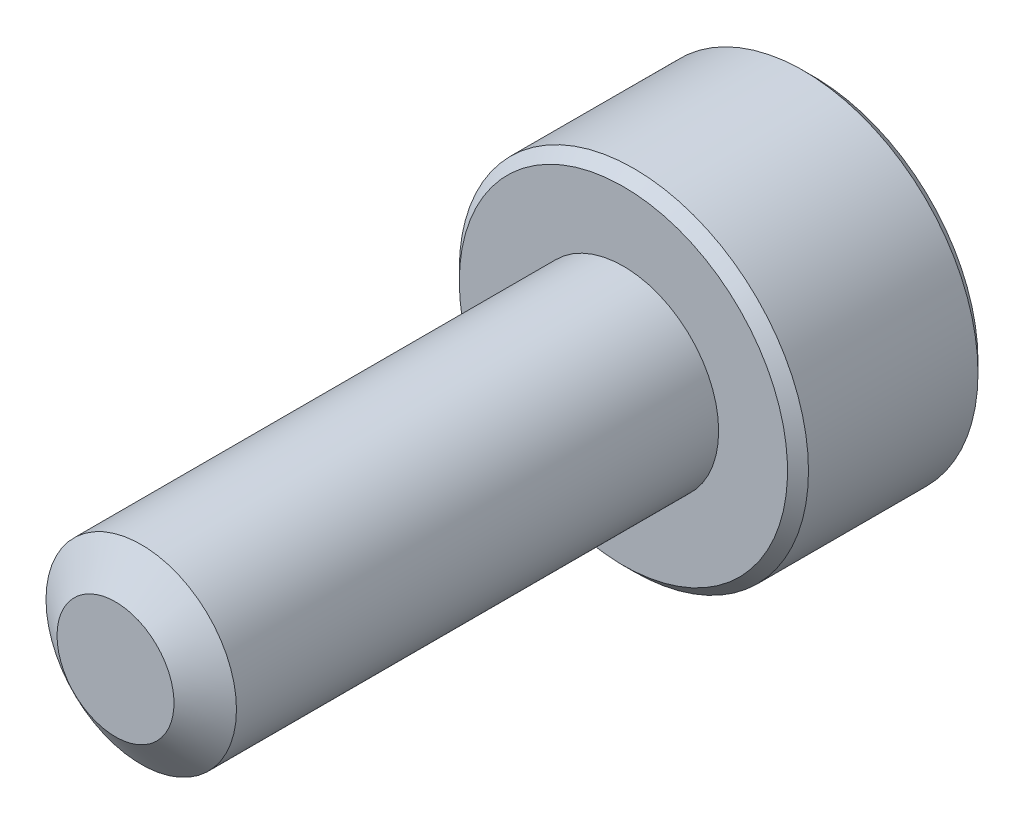
ISO-10303-21;
HEADER;
FILE_DESCRIPTION(('STEP AP214'),'2;1');
FILE_NAME('part.step','',(''),(''),'','','');
FILE_SCHEMA(('AUTOMOTIVE_DESIGN { 1 0 10303 214 1 1 1 1 }'));
ENDSEC;
DATA;
#1=APPLICATION_CONTEXT('core data for automotive mechanical design processes');
#2=APPLICATION_PROTOCOL_DEFINITION('international standard','automotive_design',2000,#1);
#3=PRODUCT_CONTEXT('',#1,'mechanical');
#4=PRODUCT('Part','Part','',(#3));
#5=PRODUCT_RELATED_PRODUCT_CATEGORY('part','',(#4));
#6=PRODUCT_DEFINITION_FORMATION('','',#4);
#7=PRODUCT_DEFINITION_CONTEXT('part definition',#1,'design');
#8=PRODUCT_DEFINITION('design','',#6,#7);
#9=PRODUCT_DEFINITION_SHAPE('','',#8);
#10=(LENGTH_UNIT() NAMED_UNIT(*) SI_UNIT(.MILLI.,.METRE.));
#11=(NAMED_UNIT(*) PLANE_ANGLE_UNIT() SI_UNIT($,.RADIAN.));
#12=(NAMED_UNIT(*) SI_UNIT($,.STERADIAN.) SOLID_ANGLE_UNIT());
#13=UNCERTAINTY_MEASURE_WITH_UNIT(LENGTH_MEASURE(1.E-05),#10,'distance_accuracy_value','');
#14=(GEOMETRIC_REPRESENTATION_CONTEXT(3) GLOBAL_UNCERTAINTY_ASSIGNED_CONTEXT((#13)) GLOBAL_UNIT_ASSIGNED_CONTEXT((#10,
#11,#12)) REPRESENTATION_CONTEXT('',''));
#15=CARTESIAN_POINT('',(0.,0.,0.));
#16=DIRECTION('',(0.,0.,1.));
#17=DIRECTION('',(1.,0.,0.));
#18=AXIS2_PLACEMENT_3D('',#15,#16,#17);
#19=CARTESIAN_POINT('',(0.,-1.44337567297406,-9.125));
#20=DIRECTION('',(-0.5,-0.866025403784439,0.));
#21=DIRECTION('',(0.866025403784439,-0.5,0.));
#22=AXIS2_PLACEMENT_3D('',#19,#20,#21);
#23=PLANE('',#22);
#24=CARTESIAN_POINT('',(-1.24999999999923,-0.721687836487472,-11.0000000000205));
#25=CARTESIAN_POINT('',(-1.20703689149526,-0.746492598747462,-10.9752190397385));
#26=CARTESIAN_POINT('',(-1.16335543595367,-0.771712098862997,-10.9518937494833));
#27=CARTESIAN_POINT('',(-1.07428446543606,-0.823137247668316,-10.9091861389306));
#28=CARTESIAN_POINT('',(-1.02888648443478,-0.849347784220073,-10.8898275733697));
#29=CARTESIAN_POINT('',(-0.937343688522001,-0.902200042082686,-10.8566662159237));
#30=CARTESIAN_POINT('',(-0.891222174141652,-0.928828310825614,-10.8427800967941));
#31=CARTESIAN_POINT('',(-0.797964038891582,-0.982670920316364,-10.8213859018106));
#32=CARTESIAN_POINT('',(-0.750830264933908,-1.00988361739875,-10.8138618619324));
#33=CARTESIAN_POINT('',(-0.669590913522095,-1.05678717880515,-10.807072827807));
#34=CARTESIAN_POINT('',(-0.635590177984652,-1.07641751262034,-10.8060681886655));
#35=CARTESIAN_POINT('',(-0.567648554675665,-1.11564362712696,-10.8077634952321));
#36=CARTESIAN_POINT('',(-0.533707681782417,-1.13523939922841,-10.8104642592724));
#37=CARTESIAN_POINT('',(-0.466153619735912,-1.17424175513581,-10.8194142483557));
#38=CARTESIAN_POINT('',(-0.432540764897579,-1.19364814592496,-10.825666773068));
#39=CARTESIAN_POINT('',(-0.36587626075785,-1.23213691533542,-10.8413835392564));
#40=CARTESIAN_POINT('',(-0.332824858668661,-1.25121915122871,-10.8508491588693));
#41=CARTESIAN_POINT('',(-0.248213569935116,-1.3000695015555,-10.8789283315911));
#42=CARTESIAN_POINT('',(-0.197186124430318,-1.32953021095376,-10.899649345075));
#43=CARTESIAN_POINT('',(-0.097127605618787,-1.38729902372431,-10.9463235058317));
#44=CARTESIAN_POINT('',(-0.0480906425343108,-1.41561052756137,-10.9722596212441));
#45=CARTESIAN_POINT('',(3.61131954926437E-12,-1.44337567297615,-11.000000000023));
#46=B_SPLINE_CURVE_WITH_KNOTS('',3,(#24,#25,#26,#27,#28,#29,#30,#31,#32,#33,#34,#35,#36,#37,#38,
#39,#40,#41,#42,#43,#44,#45),.UNSPECIFIED.,.F.,.F.,(4,2,2,2,2,2,2,2,2,2,4),(0.,
0.166478683225655,0.333926926832445,0.498716658517836,0.66309165462773,0.780745575559699,
0.898425484352725,1.0162148997715,1.13405490052567,1.32111591641725,1.50757565758986),.UNSPECIFIED.);
#47=CARTESIAN_POINT('',(-1.25000000005161,-0.721687836457233,-11.0000000000507));
#48=VERTEX_POINT('',#47);
#49=CARTESIAN_POINT('',(-5.01839715878229E-11,-1.44337567300512,-11.000000000052));
#50=VERTEX_POINT('',#49);
#51=EDGE_CURVE('E21',#48,#50,#46,.T.);
#52=ORIENTED_EDGE('',*,*,#51,.F.);
#53=DIRECTION('',(0.,0.,1.));
#54=VECTOR('',#53,1.);
#55=CARTESIAN_POINT('',(-1.25,-0.721687836487032,-9.125));
#56=LINE('',#55,#54);
#57=CARTESIAN_POINT('',(-1.25,-0.721687836487031,-9.125));
#58=VERTEX_POINT('',#57);
#59=EDGE_CURVE('E104',#48,#58,#56,.T.);
#60=ORIENTED_EDGE('',*,*,#59,.T.);
#61=DIRECTION('',(0.866025403784439,-0.5,0.));
#62=VECTOR('',#61,1.);
#63=CARTESIAN_POINT('',(0.,-1.44337567297406,-9.125));
#64=LINE('',#63,#62);
#65=CARTESIAN_POINT('',(0.,-1.44337567297406,-9.125));
#66=VERTEX_POINT('',#65);
#67=EDGE_CURVE('E77',#66,#58,#64,.F.);
#68=ORIENTED_EDGE('',*,*,#67,.F.);
#69=DIRECTION('',(0.,0.,1.));
#70=VECTOR('',#69,1.);
#71=CARTESIAN_POINT('',(0.,-1.44337567297406,-9.125));
#72=LINE('',#71,#70);
#73=EDGE_CURVE('E76',#66,#50,#72,.F.);
#74=ORIENTED_EDGE('',*,*,#73,.T.);
#75=EDGE_LOOP('',(#52,#60,#68,#74));
#76=FACE_BOUND('',#75,.T.);
#77=ADVANCED_FACE('F17',(#76),#23,.F.);
#78=CARTESIAN_POINT('',(1.25,-0.721687836487033,-9.125));
#79=DIRECTION('',(0.5,-0.866025403784439,0.));
#80=DIRECTION('',(0.866025403784439,0.5,0.));
#81=AXIS2_PLACEMENT_3D('',#78,#79,#80);
#82=PLANE('',#81);
#83=CARTESIAN_POINT('',(-3.6074023830296E-12,-1.44337567297615,-11.000000000023));
#84=CARTESIAN_POINT('',(0.0429631085006193,-1.41857091071601,-10.9752190397408));
#85=CARTESIAN_POINT('',(0.0866445640424776,-1.39335141060032,-10.9518937494853));
#86=CARTESIAN_POINT('',(0.175715534560631,-1.34192626179469,-10.909186138932));
#87=CARTESIAN_POINT('',(0.221113515562204,-1.31571572524276,-10.8898275733709));
#88=CARTESIAN_POINT('',(0.312656311475584,-1.2628634673798,-10.8566662159245));
#89=CARTESIAN_POINT('',(0.358777825856245,-1.23623519863669,-10.8427800967947));
#90=CARTESIAN_POINT('',(0.452035961106958,-1.18239258914557,-10.8213859018109));
#91=CARTESIAN_POINT('',(0.499169735064965,-1.15517989206299,-10.8138618619325));
#92=CARTESIAN_POINT('',(0.580409086477129,-1.10827633065639,-10.8070728278071));
#93=CARTESIAN_POINT('',(0.614409822014588,-1.08864599684119,-10.8060681886655));
#94=CARTESIAN_POINT('',(0.682351445323609,-1.04941988233455,-10.807763495232));
#95=CARTESIAN_POINT('',(0.716292318216875,-1.02982411023309,-10.8104642592723));
#96=CARTESIAN_POINT('',(0.783846380263412,-0.99082175432567,-10.8194142483556));
#97=CARTESIAN_POINT('',(0.81745923510176,-0.971415363536519,-10.8256667730679));
#98=CARTESIAN_POINT('',(0.884123739241519,-0.932926594126036,-10.8413835392562));
#99=CARTESIAN_POINT('',(0.917175141330723,-0.913844358232739,-10.8508491588691));
#100=CARTESIAN_POINT('',(1.0017864300636,-0.86499400790633,-10.8789283315906));
#101=CARTESIAN_POINT('',(1.05281387556774,-0.835533298508456,-10.8996493450742));
#102=CARTESIAN_POINT('',(1.15287239437801,-0.777764485738631,-10.9463235058301));
#103=CARTESIAN_POINT('',(1.20190935746189,-0.749452981901914,-10.9722596212421));
#104=CARTESIAN_POINT('',(1.24999999999923,-0.721687836487477,-11.0000000000205));
#105=B_SPLINE_CURVE_WITH_KNOTS('',3,(#83,#84,#85,#86,#87,#88,#89,#90,#91,#92,#93,#94,#95,#96,
#97,#98,#99,#100,#101,#102,#103,#104),.UNSPECIFIED.,.F.,.F.,(4,2,2,2,2,2,2,2,2,2,4),(0.,
0.166478683226823,0.333926926834808,0.498716658521388,0.66309165463246,0.780745575564486,
0.898425484357568,1.01621489977638,1.1340549005306,1.32111591641969,1.50757565758986),.UNSPECIFIED.);
#106=CARTESIAN_POINT('',(1.25,-0.721687836547066,-11.0000000000509));
#107=VERTEX_POINT('',#106);
#108=EDGE_CURVE('E84',#50,#107,#105,.T.);
#109=ORIENTED_EDGE('',*,*,#108,.F.);
#110=ORIENTED_EDGE('',*,*,#73,.F.);
#111=DIRECTION('',(-0.86602540378444,-0.499999999999997,0.));
#112=VECTOR('',#111,1.);
#113=CARTESIAN_POINT('',(1.25,-0.721687836487033,-9.125));
#114=LINE('',#113,#112);
#115=CARTESIAN_POINT('',(1.25,-0.721687836487033,-9.125));
#116=VERTEX_POINT('',#115);
#117=EDGE_CURVE('E272',#116,#66,#114,.T.);
#118=ORIENTED_EDGE('',*,*,#117,.F.);
#119=DIRECTION('',(0.,0.,-1.));
#120=VECTOR('',#119,1.);
#121=CARTESIAN_POINT('',(1.25,-0.721687836487033,-9.125));
#122=LINE('',#121,#120);
#123=EDGE_CURVE('E103',#116,#107,#122,.T.);
#124=ORIENTED_EDGE('',*,*,#123,.T.);
#125=EDGE_LOOP('',(#109,#110,#118,#124));
#126=FACE_BOUND('',#125,.T.);
#127=ADVANCED_FACE('F101',(#126),#82,.F.);
#128=CARTESIAN_POINT('',(-1.25,-0.721687836487032,-9.125));
#129=DIRECTION('',(-1.,0.,0.));
#130=DIRECTION('',(0.,-1.,0.));
#131=AXIS2_PLACEMENT_3D('',#128,#129,#130);
#132=PLANE('',#131);
#133=CARTESIAN_POINT('',(-1.25,0.721687836486145,-11.0000000000205));
#134=CARTESIAN_POINT('',(-1.25,0.672078311978691,-10.9752190397376));
#135=CARTESIAN_POINT('',(-1.25,0.621639311760224,-10.9518937494808));
#136=CARTESIAN_POINT('',(-1.25,0.51878901417478,-10.9091861389237));
#137=CARTESIAN_POINT('',(-1.25,0.466367941083855,-10.88982757336));
#138=CARTESIAN_POINT('',(-1.25,0.360663425383132,-10.8566662159065));
#139=CARTESIAN_POINT('',(-1.25,0.307406887909187,-10.8427800967724));
#140=CARTESIAN_POINT('',(-1.25,0.199721668950897,-10.8213859017783));
#141=CARTESIAN_POINT('',(-1.25,0.145296274797427,-10.8138618618939));
#142=CARTESIAN_POINT('',(-1.25,0.0514891520108285,-10.8070728277577));
#143=CARTESIAN_POINT('',(-1.25,0.0122284843956205,-10.806068188611));
#144=CARTESIAN_POINT('',(-1.25,-0.0662237445878595,-10.8077634951655));
#145=CARTESIAN_POINT('',(-1.25,-0.105415288776155,-10.810464259199));
#146=CARTESIAN_POINT('',(-1.25,-0.183420000562422,-10.8194142482674));
#147=CARTESIAN_POINT('',(-1.25,-0.222232782126771,-10.8256667729716));
#148=CARTESIAN_POINT('',(-1.25,-0.299210320920453,-10.841383539143));
#149=CARTESIAN_POINT('',(-1.25,-0.337374792693718,-10.8508491587471));
#150=CARTESIAN_POINT('',(-1.25,-0.435075493390417,-10.8789283314678));
#151=CARTESIAN_POINT('',(-1.25,-0.493996912241092,-10.8996493449682));
#152=CARTESIAN_POINT('',(-1.25,-0.609534537885974,-10.9463235057696));
#153=CARTESIAN_POINT('',(-1.25,-0.666157545609713,-10.9722596212102));
#154=CARTESIAN_POINT('',(-1.25,-0.721687836486145,-11.0000000000205));
#155=B_SPLINE_CURVE_WITH_KNOTS('',3,(#133,#134,#135,#136,#137,#138,#139,#140,#141,#142,#143,
#144,#145,#146,#147,#148,#149,#150,#151,#152,#153,#154),.UNSPECIFIED.,.F.,.F.,(4,2,2,2,2,2,2,2,
2,2,4),(0.,0.166478683193298,0.333926926767723,0.498716658422077,0.663091654500959,
0.780745575387943,0.89842548413593,1.0162148995096,1.13405490021865,1.32111591627871,
1.5075756576204),.UNSPECIFIED.);
#156=CARTESIAN_POINT('',(-1.25,0.721687836546622,-11.0000000000507));
#157=VERTEX_POINT('',#156);
#158=EDGE_CURVE('E61',#157,#48,#155,.T.);
#159=ORIENTED_EDGE('',*,*,#158,.F.);
#160=DIRECTION('',(0.,0.,1.));
#161=VECTOR('',#160,1.);
#162=CARTESIAN_POINT('',(-1.25,0.721687836487032,-9.125));
#163=LINE('',#162,#161);
#164=CARTESIAN_POINT('',(-1.25,0.721687836487032,-9.125));
#165=VERTEX_POINT('',#164);
#166=EDGE_CURVE('E249',#157,#165,#163,.T.);
#167=ORIENTED_EDGE('',*,*,#166,.T.);
#168=DIRECTION('',(0.,1.,0.));
#169=VECTOR('',#168,1.);
#170=CARTESIAN_POINT('',(-1.25,2.1650635094611,-9.125));
#171=LINE('',#170,#169);
#172=EDGE_CURVE('E268',#58,#165,#171,.T.);
#173=ORIENTED_EDGE('',*,*,#172,.F.);
#174=ORIENTED_EDGE('',*,*,#59,.F.);
#175=EDGE_LOOP('',(#159,#167,#173,#174));
#176=FACE_BOUND('',#175,.T.);
#177=ADVANCED_FACE('F122',(#176),#132,.F.);
#178=CARTESIAN_POINT('',(1.25,2.1650635094611,-9.125));
#179=DIRECTION('',(0.,0.,-1.));
#180=DIRECTION('',(-1.,0.,0.));
#181=AXIS2_PLACEMENT_3D('',#178,#179,#180);
#182=PLANE('',#181);
#183=ORIENTED_EDGE('',*,*,#67,.T.);
#184=ORIENTED_EDGE('',*,*,#172,.T.);
#185=DIRECTION('',(-0.866025403784439,-0.5,0.));
#186=VECTOR('',#185,1.);
#187=CARTESIAN_POINT('',(-1.25,0.721687836487032,-9.125));
#188=LINE('',#187,#186);
#189=CARTESIAN_POINT('',(0.,1.44337567297406,-9.125));
#190=VERTEX_POINT('',#189);
#191=EDGE_CURVE('E144',#165,#190,#188,.F.);
#192=ORIENTED_EDGE('',*,*,#191,.T.);
#193=DIRECTION('',(-0.866025403784439,0.5,0.));
#194=VECTOR('',#193,1.);
#195=CARTESIAN_POINT('',(0.,1.44337567297406,-9.125));
#196=LINE('',#195,#194);
#197=CARTESIAN_POINT('',(1.25,0.721687836487029,-9.125));
#198=VERTEX_POINT('',#197);
#199=EDGE_CURVE('E246',#190,#198,#196,.F.);
#200=ORIENTED_EDGE('',*,*,#199,.T.);
#201=DIRECTION('',(0.,1.,0.));
#202=VECTOR('',#201,1.);
#203=CARTESIAN_POINT('',(1.25,0.721687836487032,-9.125));
#204=LINE('',#203,#202);
#205=EDGE_CURVE('E263',#198,#116,#204,.F.);
#206=ORIENTED_EDGE('',*,*,#205,.T.);
#207=ORIENTED_EDGE('',*,*,#117,.T.);
#208=EDGE_LOOP('',(#183,#184,#192,#200,#206,#207));
#209=FACE_BOUND('',#208,.T.);
#210=ADVANCED_FACE('F126',(#209),#182,.T.);
#211=CARTESIAN_POINT('',(1.25,0.721687836487032,-9.125));
#212=DIRECTION('',(1.,0.,0.));
#213=DIRECTION('',(0.,0.,-1.));
#214=AXIS2_PLACEMENT_3D('',#211,#212,#213);
#215=PLANE('',#214);
#216=CARTESIAN_POINT('',(1.25,-0.721687836486145,-11.0000000000205));
#217=CARTESIAN_POINT('',(1.25,-0.672078311978688,-10.9752190397376));
#218=CARTESIAN_POINT('',(1.25,-0.621639311760217,-10.9518937494808));
#219=CARTESIAN_POINT('',(1.25,-0.518789014174766,-10.9091861389237));
#220=CARTESIAN_POINT('',(1.25,-0.466367941083838,-10.88982757336));
#221=CARTESIAN_POINT('',(1.25,-0.360663425383114,-10.8566662159065));
#222=CARTESIAN_POINT('',(1.25,-0.307406887909172,-10.8427800967724));
#223=CARTESIAN_POINT('',(1.25,-0.199721668950889,-10.8213859017783));
#224=CARTESIAN_POINT('',(1.25,-0.145296274797422,-10.8138618618939));
#225=CARTESIAN_POINT('',(1.25,-0.0514891520108276,-10.8070728277577));
#226=CARTESIAN_POINT('',(1.25,-0.0122284843956208,-10.806068188611));
#227=CARTESIAN_POINT('',(1.25,0.0662237445878569,-10.8077634951655));
#228=CARTESIAN_POINT('',(1.25,0.105415288776151,-10.810464259199));
#229=CARTESIAN_POINT('',(1.25,0.183420000562418,-10.8194142482673));
#230=CARTESIAN_POINT('',(1.25,0.222232782126768,-10.8256667729716));
#231=CARTESIAN_POINT('',(1.25,0.299210320920453,-10.841383539143));
#232=CARTESIAN_POINT('',(1.25,0.337374792693719,-10.8508491587471));
#233=CARTESIAN_POINT('',(1.25,0.435075493391091,-10.878928331468));
#234=CARTESIAN_POINT('',(1.25,0.493996912242415,-10.8996493449686));
#235=CARTESIAN_POINT('',(1.25,0.609534537888543,-10.9463235057707));
#236=CARTESIAN_POINT('',(1.25,0.66615754561288,-10.9722596212117));
#237=CARTESIAN_POINT('',(1.25,0.721687836489885,-11.0000000000223));
#238=B_SPLINE_CURVE_WITH_KNOTS('',3,(#216,#217,#218,#219,#220,#221,#222,#223,#224,#225,#226,
#227,#228,#229,#230,#231,#232,#233,#234,#235,#236,#237),.UNSPECIFIED.,.F.,.F.,(4,2,2,2,2,2,2,2,
2,2,4),(0.,0.166478683193309,0.333926926767745,0.498716658422089,0.663091654500961,
0.780745575387941,0.898425484135925,1.0162148995096,1.13405490021866,1.32111591628081,
1.50757565762458),.UNSPECIFIED.);
#239=CARTESIAN_POINT('',(1.25000000002599,0.721687836502039,-11.0000000000509));
#240=VERTEX_POINT('',#239);
#241=EDGE_CURVE('E40',#107,#240,#238,.T.);
#242=ORIENTED_EDGE('',*,*,#241,.F.);
#243=ORIENTED_EDGE('',*,*,#123,.F.);
#244=ORIENTED_EDGE('',*,*,#205,.F.);
#245=DIRECTION('',(0.,0.,1.));
#246=VECTOR('',#245,1.);
#247=CARTESIAN_POINT('',(1.25,0.721687836487029,-9.125));
#248=LINE('',#247,#246);
#249=EDGE_CURVE('E242',#198,#240,#248,.F.);
#250=ORIENTED_EDGE('',*,*,#249,.T.);
#251=EDGE_LOOP('',(#242,#243,#244,#250));
#252=FACE_BOUND('',#251,.T.);
#253=ADVANCED_FACE('F130',(#252),#215,.F.);
#254=CARTESIAN_POINT('',(-1.25,0.721687836487032,-9.125));
#255=DIRECTION('',(-0.5,0.866025403784439,0.));
#256=DIRECTION('',(-0.866025403784439,-0.5,0.));
#257=AXIS2_PLACEMENT_3D('',#254,#255,#256);
#258=PLANE('',#257);
#259=CARTESIAN_POINT('',(6.84630244901692E-12,1.44337567297802,-11.0000000000249));
#260=CARTESIAN_POINT('',(-0.0429631084975728,1.41857091071777,-10.9752190397424));
#261=CARTESIAN_POINT('',(-0.0866445640396289,1.39335141060197,-10.9518937494867));
#262=CARTESIAN_POINT('',(-0.175715534558197,1.34192626179609,-10.9091861389331));
#263=CARTESIAN_POINT('',(-0.221113515559987,1.31571572524404,-10.8898275733718));
#264=CARTESIAN_POINT('',(-0.312656311473812,1.26286346738082,-10.856666215925));
#265=CARTESIAN_POINT('',(-0.358777825854701,1.23623519863758,-10.8427800967951));
#266=CARTESIAN_POINT('',(-0.452035961105885,1.18239258914619,-10.821385901811));
#267=CARTESIAN_POINT('',(-0.499169735064134,1.15517989206347,-10.8138618619326));
#268=CARTESIAN_POINT('',(-0.580409086476554,1.10827633065672,-10.8070728278071));
#269=CARTESIAN_POINT('',(-0.614409822014024,1.08864599684152,-10.8060681886655));
#270=CARTESIAN_POINT('',(-0.682351445323067,1.04941988233486,-10.807763495232));
#271=CARTESIAN_POINT('',(-0.716292318216345,1.0298241102334,-10.8104642592723));
#272=CARTESIAN_POINT('',(-0.783846380262906,0.990821754325961,-10.8194142483555));
#273=CARTESIAN_POINT('',(-0.817459235101266,0.971415363536803,-10.8256667730678));
#274=CARTESIAN_POINT('',(-0.884123739241049,0.932926594126306,-10.8413835392561));
#275=CARTESIAN_POINT('',(-0.917175141330265,0.913844358233003,-10.8508491588689));
#276=CARTESIAN_POINT('',(-1.00178643006323,0.864994007906542,-10.8789283315905));
#277=CARTESIAN_POINT('',(-1.05281387556745,0.835533298508624,-10.899649345074));
#278=CARTESIAN_POINT('',(-1.15287239437787,0.777764485738712,-10.94632350583));
#279=CARTESIAN_POINT('',(-1.20190935746182,0.749452981901953,-10.972259621242));
#280=CARTESIAN_POINT('',(-1.24999999999923,0.721687836487475,-11.0000000000205));
#281=B_SPLINE_CURVE_WITH_KNOTS('',3,(#259,#260,#261,#262,#263,#264,#265,#266,#267,#268,#269,
#270,#271,#272,#273,#274,#275,#276,#277,#278,#279,#280),.UNSPECIFIED.,.F.,.F.,(4,2,2,2,2,2,2,2,
2,2,4),(0.,0.166478683227699,0.333926926836579,0.498716658524029,0.663091654635963,
0.780745575568026,0.898425484361146,1.01621489977999,1.13405490053424,1.3211159164236,
1.50757565759404),.UNSPECIFIED.);
#282=CARTESIAN_POINT('',(-4.8570560907805E-11,1.44337567300606,-11.0000000000529));
#283=VERTEX_POINT('',#282);
#284=EDGE_CURVE('E145',#283,#157,#281,.T.);
#285=ORIENTED_EDGE('',*,*,#284,.F.);
#286=DIRECTION('',(0.,0.,1.));
#287=VECTOR('',#286,1.);
#288=CARTESIAN_POINT('',(0.,1.44337567297406,-9.125));
#289=LINE('',#288,#287);
#290=EDGE_CURVE('E170',#283,#190,#289,.T.);
#291=ORIENTED_EDGE('',*,*,#290,.T.);
#292=ORIENTED_EDGE('',*,*,#191,.F.);
#293=ORIENTED_EDGE('',*,*,#166,.F.);
#294=EDGE_LOOP('',(#285,#291,#292,#293));
#295=FACE_BOUND('',#294,.T.);
#296=ADVANCED_FACE('F135',(#295),#258,.F.);
#297=CARTESIAN_POINT('',(0.,1.44337567297406,-9.125));
#298=DIRECTION('',(0.5,0.866025403784439,0.));
#299=DIRECTION('',(-0.866025403784439,0.5,0.));
#300=AXIS2_PLACEMENT_3D('',#297,#298,#299);
#301=PLANE('',#300);
#302=CARTESIAN_POINT('',(-6.8491199462737E-12,1.44337567297801,-11.0000000000249));
#303=CARTESIAN_POINT('',(0.042963108497573,1.41857091071776,-10.9752190397424));
#304=CARTESIAN_POINT('',(0.0866445640396318,1.39335141060196,-10.9518937494867));
#305=CARTESIAN_POINT('',(0.175715534558206,1.34192626179608,-10.9091861389331));
#306=CARTESIAN_POINT('',(0.221113515559999,1.31571572524403,-10.8898275733718));
#307=CARTESIAN_POINT('',(0.312656311473824,1.26286346738081,-10.856666215925));
#308=CARTESIAN_POINT('',(0.35877782585471,1.23623519863757,-10.8427800967951));
#309=CARTESIAN_POINT('',(0.452035961105888,1.18239258914618,-10.821385901811));
#310=CARTESIAN_POINT('',(0.499169735064134,1.15517989206347,-10.8138618619326));
#311=CARTESIAN_POINT('',(0.58040908647655,1.10827633065672,-10.8070728278071));
#312=CARTESIAN_POINT('',(0.614409822014018,1.08864599684152,-10.8060681886655));
#313=CARTESIAN_POINT('',(0.682351445323059,1.04941988233486,-10.807763495232));
#314=CARTESIAN_POINT('',(0.716292318216336,1.0298241102334,-10.8104642592723));
#315=CARTESIAN_POINT('',(0.783846380262897,0.990821754325963,-10.8194142483555));
#316=CARTESIAN_POINT('',(0.817459235101258,0.971415363536804,-10.8256667730678));
#317=CARTESIAN_POINT('',(0.884123739241042,0.932926594126306,-10.8413835392561));
#318=CARTESIAN_POINT('',(0.91717514133026,0.913844358233002,-10.8508491588689));
#319=CARTESIAN_POINT('',(1.00178643006381,0.864994007906204,-10.8789283315907));
#320=CARTESIAN_POINT('',(1.05281387556859,0.835533298507962,-10.8996493450745));
#321=CARTESIAN_POINT('',(1.15287239438009,0.777764485737426,-10.9463235058311));
#322=CARTESIAN_POINT('',(1.20190935746456,0.749452981900368,-10.9722596212435));
#323=CARTESIAN_POINT('',(1.25000000000247,0.721687836485602,-11.0000000000223));
#324=B_SPLINE_CURVE_WITH_KNOTS('',3,(#302,#303,#304,#305,#306,#307,#308,#309,#310,#311,#312,
#313,#314,#315,#316,#317,#318,#319,#320,#321,#322,#323),.UNSPECIFIED.,.F.,.F.,(4,2,2,2,2,2,2,2,
2,2,4),(0.,0.166478683227709,0.3339269268366,0.49871665852404,0.663091654635962,
0.780745575568021,0.898425484361137,1.01621489977999,1.13405490053424,1.3211159164257,
1.50757565759821),.UNSPECIFIED.);
#325=EDGE_CURVE('E162',#283,#240,#324,.T.);
#326=ORIENTED_EDGE('',*,*,#325,.T.);
#327=ORIENTED_EDGE('',*,*,#249,.F.);
#328=ORIENTED_EDGE('',*,*,#199,.F.);
#329=ORIENTED_EDGE('',*,*,#290,.F.);
#330=EDGE_LOOP('',(#326,#327,#328,#329));
#331=FACE_BOUND('',#330,.T.);
#332=ADVANCED_FACE('F172',(#331),#301,.F.);
#333=CARTESIAN_POINT('',(0.,0.,-10.9999999999673));
#334=DIRECTION('',(0.,0.,-1.));
#335=DIRECTION('',(-1.,0.,0.));
#336=AXIS2_PLACEMENT_3D('',#333,#334,#335);
#337=CONICAL_SURFACE('',#336,1.44337567292041,0.785398163397448);
#338=ORIENTED_EDGE('',*,*,#284,.T.);
#339=CARTESIAN_POINT('',(0.,0.,-11.0000000000809));
#340=DIRECTION('',(0.,0.,-1.));
#341=DIRECTION('',(-1.,0.,0.));
#342=AXIS2_PLACEMENT_3D('',#339,#340,#341);
#343=CIRCLE('',#342,1.4433756730341);
#344=EDGE_CURVE('E169',#283,#157,#343,.F.);
#345=ORIENTED_EDGE('',*,*,#344,.F.);
#346=EDGE_LOOP('',(#338,#345));
#347=FACE_BOUND('',#346,.T.);
#348=ADVANCED_FACE('F175',(#347),#337,.F.);
#349=CARTESIAN_POINT('',(0.,0.,-10.9999999999673));
#350=DIRECTION('',(0.,0.,-1.));
#351=DIRECTION('',(-1.,0.,0.));
#352=AXIS2_PLACEMENT_3D('',#349,#350,#351);
#353=CONICAL_SURFACE('',#352,1.44337567292041,0.785398163251348);
#354=CARTESIAN_POINT('',(0.,0.,-11.0000000000241));
#355=DIRECTION('',(0.,0.,-1.));
#356=DIRECTION('',(-1.,0.,0.));
#357=AXIS2_PLACEMENT_3D('',#354,#355,#356);
#358=CIRCLE('',#357,1.44337567297725);
#359=EDGE_CURVE('E94',#157,#48,#358,.F.);
#360=ORIENTED_EDGE('',*,*,#359,.F.);
#361=ORIENTED_EDGE('',*,*,#158,.T.);
#362=EDGE_LOOP('',(#360,#361));
#363=FACE_BOUND('',#362,.T.);
#364=ADVANCED_FACE('F179',(#363),#353,.F.);
#365=CARTESIAN_POINT('',(0.,0.,-10.9999999999673));
#366=DIRECTION('',(0.,0.,-1.));
#367=DIRECTION('',(-1.,0.,0.));
#368=AXIS2_PLACEMENT_3D('',#365,#366,#367);
#369=CONICAL_SURFACE('',#368,1.44337567292041,0.785398163397448);
#370=ORIENTED_EDGE('',*,*,#51,.T.);
#371=CARTESIAN_POINT('',(0.,0.,-11.0000000000809));
#372=DIRECTION('',(0.,0.,-1.));
#373=DIRECTION('',(-1.,0.,0.));
#374=AXIS2_PLACEMENT_3D('',#371,#372,#373);
#375=CIRCLE('',#374,1.4433756730341);
#376=EDGE_CURVE('E72',#48,#50,#375,.F.);
#377=ORIENTED_EDGE('',*,*,#376,.F.);
#378=EDGE_LOOP('',(#370,#377));
#379=FACE_BOUND('',#378,.T.);
#380=ADVANCED_FACE('F70',(#379),#369,.F.);
#381=CARTESIAN_POINT('',(0.,0.,-10.9999999999673));
#382=DIRECTION('',(0.,0.,-1.));
#383=DIRECTION('',(-1.,0.,0.));
#384=AXIS2_PLACEMENT_3D('',#381,#382,#383);
#385=CONICAL_SURFACE('',#384,1.44337567292041,0.785398163397448);
#386=ORIENTED_EDGE('',*,*,#108,.T.);
#387=CARTESIAN_POINT('',(0.,0.,-11.0000000000809));
#388=DIRECTION('',(0.,0.,-1.));
#389=DIRECTION('',(-1.,0.,0.));
#390=AXIS2_PLACEMENT_3D('',#387,#388,#389);
#391=CIRCLE('',#390,1.4433756730341);
#392=EDGE_CURVE('E92',#50,#107,#391,.F.);
#393=ORIENTED_EDGE('',*,*,#392,.F.);
#394=EDGE_LOOP('',(#386,#393));
#395=FACE_BOUND('',#394,.T.);
#396=ADVANCED_FACE('F97',(#395),#385,.F.);
#397=CARTESIAN_POINT('',(0.,0.,-10.9999999999673));
#398=DIRECTION('',(0.,0.,-1.));
#399=DIRECTION('',(-1.,0.,0.));
#400=AXIS2_PLACEMENT_3D('',#397,#398,#399);
#401=CONICAL_SURFACE('',#400,1.44337567292041,0.785398163251348);
#402=ORIENTED_EDGE('',*,*,#241,.T.);
#403=CARTESIAN_POINT('',(0.,0.,-11.0000000000241));
#404=DIRECTION('',(0.,0.,-1.));
#405=DIRECTION('',(-1.,0.,0.));
#406=AXIS2_PLACEMENT_3D('',#403,#404,#405);
#407=CIRCLE('',#406,1.44337567297725);
#408=EDGE_CURVE('E99',#107,#240,#407,.F.);
#409=ORIENTED_EDGE('',*,*,#408,.F.);
#410=EDGE_LOOP('',(#402,#409));
#411=FACE_BOUND('',#410,.T.);
#412=ADVANCED_FACE('F152',(#411),#401,.F.);
#413=CARTESIAN_POINT('',(0.,0.,-10.9999999999673));
#414=DIRECTION('',(0.,0.,-1.));
#415=DIRECTION('',(-1.,0.,0.));
#416=AXIS2_PLACEMENT_3D('',#413,#414,#415);
#417=CONICAL_SURFACE('',#416,1.44337567292041,0.785398163397448);
#418=ORIENTED_EDGE('',*,*,#325,.F.);
#419=CARTESIAN_POINT('',(0.,0.,-11.0000000000809));
#420=DIRECTION('',(0.,0.,-1.));
#421=DIRECTION('',(-1.,0.,0.));
#422=AXIS2_PLACEMENT_3D('',#419,#420,#421);
#423=CIRCLE('',#422,1.4433756730341);
#424=EDGE_CURVE('E234',#240,#283,#423,.F.);
#425=ORIENTED_EDGE('',*,*,#424,.F.);
#426=EDGE_LOOP('',(#418,#425));
#427=FACE_BOUND('',#426,.T.);
#428=ADVANCED_FACE('F156',(#427),#417,.F.);
#429=CARTESIAN_POINT('',(0.,0.,-11.));
#430=DIRECTION('',(0.,0.,-1.));
#431=DIRECTION('',(-1.,0.,0.));
#432=AXIS2_PLACEMENT_3D('',#429,#430,#431);
#433=PLANE('',#432);
#434=ORIENTED_EDGE('',*,*,#408,.T.);
#435=ORIENTED_EDGE('',*,*,#424,.T.);
#436=ORIENTED_EDGE('',*,*,#344,.T.);
#437=ORIENTED_EDGE('',*,*,#359,.T.);
#438=ORIENTED_EDGE('',*,*,#376,.T.);
#439=ORIENTED_EDGE('',*,*,#392,.T.);
#440=EDGE_LOOP('',(#434,#435,#436,#437,#438,#439));
#441=FACE_BOUND('',#440,.T.);
#442=CARTESIAN_POINT('',(0.,0.,-10.9999999999673));
#443=DIRECTION('',(0.,0.,1.));
#444=DIRECTION('',(1.,0.,0.));
#445=AXIS2_PLACEMENT_3D('',#442,#443,#444);
#446=CIRCLE('',#445,2.58500000012418);
#447=CARTESIAN_POINT('',(2.58500000012418,0.,-10.9999999999673));
#448=VERTEX_POINT('',#447);
#449=EDGE_CURVE('E225',#448,#448,#446,.T.);
#450=ORIENTED_EDGE('',*,*,#449,.F.);
#451=EDGE_LOOP('',(#450));
#452=FACE_BOUND('',#451,.T.);
#453=ADVANCED_FACE('F90',(#441,#452),#433,.T.);
#454=CARTESIAN_POINT('',(0.,0.,-10.8350000000428));
#455=DIRECTION('',(0.,0.,1.));
#456=DIRECTION('',(1.,0.,0.));
#457=AXIS2_PLACEMENT_3D('',#454,#455,#456);
#458=CONICAL_SURFACE('',#457,2.75000000004866,0.785398163397448);
#459=ORIENTED_EDGE('',*,*,#449,.T.);
#460=EDGE_LOOP('',(#459));
#461=FACE_BOUND('',#460,.T.);
#462=CARTESIAN_POINT('',(0.,0.,-10.835));
#463=DIRECTION('',(0.,0.,1.));
#464=DIRECTION('',(1.,0.,0.));
#465=AXIS2_PLACEMENT_3D('',#462,#463,#464);
#466=CIRCLE('',#465,2.75);
#467=CARTESIAN_POINT('',(2.75,0.,-10.835));
#468=VERTEX_POINT('',#467);
#469=EDGE_CURVE('E228',#468,#468,#466,.T.);
#470=ORIENTED_EDGE('',*,*,#469,.F.);
#471=EDGE_LOOP('',(#470));
#472=FACE_BOUND('',#471,.T.);
#473=ADVANCED_FACE('F215',(#461,#472),#458,.T.);
#474=CARTESIAN_POINT('',(0.,0.,-11.));
#475=DIRECTION('',(0.,0.,1.));
#476=DIRECTION('',(1.,0.,0.));
#477=AXIS2_PLACEMENT_3D('',#474,#475,#476);
#478=CYLINDRICAL_SURFACE('',#477,2.75);
#479=ORIENTED_EDGE('',*,*,#469,.T.);
#480=EDGE_LOOP('',(#479));
#481=FACE_BOUND('',#480,.T.);
#482=CARTESIAN_POINT('',(0.,0.,-8.16499999996267));
#483=DIRECTION('',(0.,0.,-1.));
#484=DIRECTION('',(-1.,0.,0.));
#485=AXIS2_PLACEMENT_3D('',#482,#483,#484);
#486=CIRCLE('',#485,2.74999999999181);
#487=CARTESIAN_POINT('',(-2.74999999999181,0.,-8.16499999996267));
#488=VERTEX_POINT('',#487);
#489=EDGE_CURVE('E229',#488,#488,#486,.F.);
#490=ORIENTED_EDGE('',*,*,#489,.F.);
#491=EDGE_LOOP('',(#490));
#492=FACE_BOUND('',#491,.T.);
#493=ADVANCED_FACE('F212',(#481,#492),#478,.T.);
#494=CARTESIAN_POINT('',(0.,0.,0.));
#495=DIRECTION('',(0.,0.,1.));
#496=DIRECTION('',(1.,0.,0.));
#497=AXIS2_PLACEMENT_3D('',#494,#495,#496);
#498=PLANE('',#497);
#499=CARTESIAN_POINT('',(0.,0.,5.6843418860808E-11));
#500=DIRECTION('',(0.,0.,-1.));
#501=DIRECTION('',(-1.,0.,0.));
#502=AXIS2_PLACEMENT_3D('',#499,#500,#501);
#503=CIRCLE('',#502,0.921240473587659);
#504=CARTESIAN_POINT('',(-0.921240473587659,0.,5.6843418860808E-11));
#505=VERTEX_POINT('',#504);
#506=EDGE_CURVE('E232',#505,#505,#503,.T.);
#507=ORIENTED_EDGE('',*,*,#506,.F.);
#508=EDGE_LOOP('',(#507));
#509=FACE_BOUND('',#508,.T.);
#510=ADVANCED_FACE('F208',(#509),#498,.T.);
#511=CARTESIAN_POINT('',(0.,0.,-8.16499999996267));
#512=DIRECTION('',(0.,0.,-1.));
#513=DIRECTION('',(-1.,0.,0.));
#514=AXIS2_PLACEMENT_3D('',#511,#512,#513);
#515=CONICAL_SURFACE('',#514,2.74999999999181,0.785398163397448);
#516=CARTESIAN_POINT('',(0.,0.,-7.99999999992451));
#517=DIRECTION('',(0.,0.,-1.));
#518=DIRECTION('',(-1.,0.,0.));
#519=AXIS2_PLACEMENT_3D('',#516,#517,#518);
#520=CIRCLE('',#519,2.58499999995365);
#521=CARTESIAN_POINT('',(-2.58499999995365,0.,-7.99999999992451));
#522=VERTEX_POINT('',#521);
#523=EDGE_CURVE('E287',#522,#522,#520,.T.);
#524=ORIENTED_EDGE('',*,*,#523,.T.);
#525=EDGE_LOOP('',(#524));
#526=FACE_BOUND('',#525,.T.);
#527=ORIENTED_EDGE('',*,*,#489,.T.);
#528=EDGE_LOOP('',(#527));
#529=FACE_BOUND('',#528,.T.);
#530=ADVANCED_FACE('F204',(#526,#529),#515,.T.);
#531=CARTESIAN_POINT('',(0.,0.,-0.405251783149652));
#532=DIRECTION('',(0.,0.,-1.));
#533=DIRECTION('',(-1.,0.,0.));
#534=AXIS2_PLACEMENT_3D('',#531,#532,#533);
#535=CONICAL_SURFACE('',#534,1.50000000002137,0.959931088612039);
#536=ORIENTED_EDGE('',*,*,#506,.T.);
#537=EDGE_LOOP('',(#536));
#538=FACE_BOUND('',#537,.T.);
#539=CARTESIAN_POINT('',(0.,0.,-0.405251783209379));
#540=DIRECTION('',(0.,0.,1.));
#541=DIRECTION('',(1.,0.,0.));
#542=AXIS2_PLACEMENT_3D('',#539,#540,#541);
#543=CIRCLE('',#542,1.5);
#544=CARTESIAN_POINT('',(1.5,0.,-0.405251783209379));
#545=VERTEX_POINT('',#544);
#546=EDGE_CURVE('E32',#545,#545,#543,.F.);
#547=ORIENTED_EDGE('',*,*,#546,.F.);
#548=EDGE_LOOP('',(#547));
#549=FACE_BOUND('',#548,.T.);
#550=ADVANCED_FACE('F197',(#538,#549),#535,.T.);
#551=CARTESIAN_POINT('',(0.,0.,-8.));
#552=DIRECTION('',(0.,0.,-1.));
#553=DIRECTION('',(-1.,0.,0.));
#554=AXIS2_PLACEMENT_3D('',#551,#552,#553);
#555=PLANE('',#554);
#556=CARTESIAN_POINT('',(0.,0.,-8.));
#557=DIRECTION('',(0.,0.,1.));
#558=DIRECTION('',(1.,0.,0.));
#559=AXIS2_PLACEMENT_3D('',#556,#557,#558);
#560=CIRCLE('',#559,1.5);
#561=CARTESIAN_POINT('',(1.5,0.,-8.));
#562=VERTEX_POINT('',#561);
#563=EDGE_CURVE('E11',#562,#562,#560,.T.);
#564=ORIENTED_EDGE('',*,*,#563,.F.);
#565=EDGE_LOOP('',(#564));
#566=FACE_BOUND('',#565,.T.);
#567=ORIENTED_EDGE('',*,*,#523,.F.);
#568=EDGE_LOOP('',(#567));
#569=FACE_BOUND('',#568,.T.);
#570=ADVANCED_FACE('F191',(#566,#569),#555,.F.);
#571=CARTESIAN_POINT('',(0.,0.,-8.));
#572=DIRECTION('',(0.,0.,1.));
#573=DIRECTION('',(1.,0.,0.));
#574=AXIS2_PLACEMENT_3D('',#571,#572,#573);
#575=CYLINDRICAL_SURFACE('',#574,1.5);
#576=ORIENTED_EDGE('',*,*,#563,.T.);
#577=EDGE_LOOP('',(#576));
#578=FACE_BOUND('',#577,.T.);
#579=ORIENTED_EDGE('',*,*,#546,.T.);
#580=EDGE_LOOP('',(#579));
#581=FACE_BOUND('',#580,.T.);
#582=ADVANCED_FACE('F189',(#578,#581),#575,.T.);
#583=CLOSED_SHELL('',(#77,#127,#177,#210,#253,#296,#332,#348,#364,#380,#396,#412,#428,#453,#473,
#493,#510,#530,#550,#570,#582));
#584=MANIFOLD_SOLID_BREP('B1',#583);
#585=ADVANCED_BREP_SHAPE_REPRESENTATION('',(#18,#584),#14);
#586=SHAPE_DEFINITION_REPRESENTATION(#9,#585);
ENDSEC;
END-ISO-10303-21;
